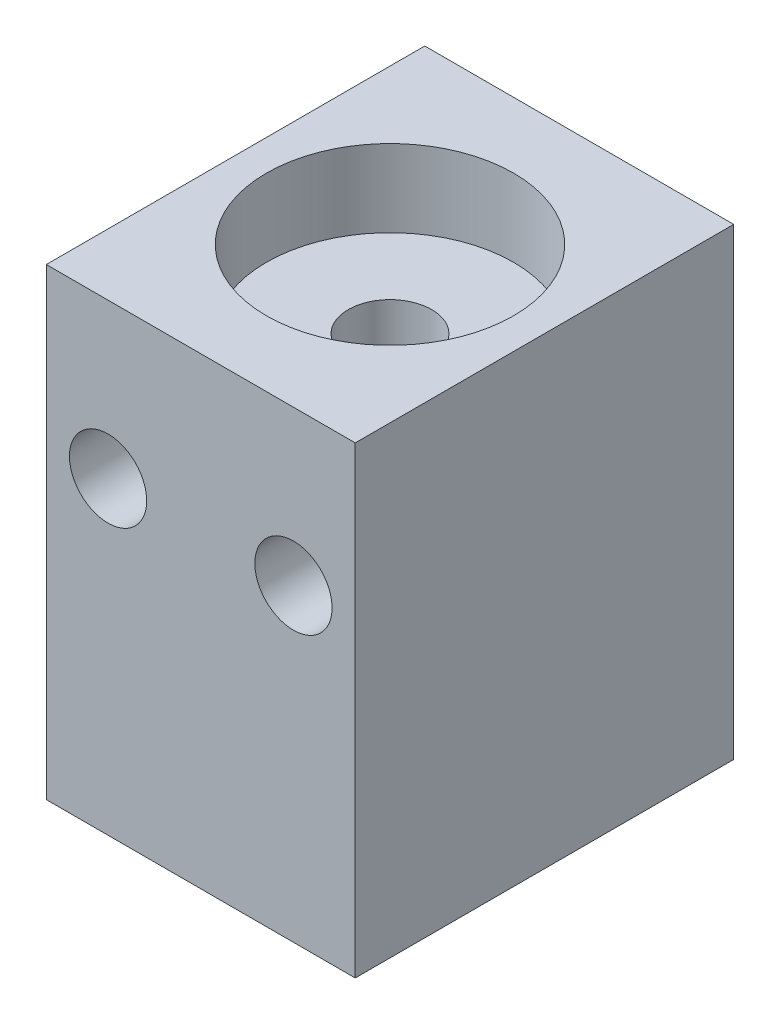
ISO-10303-21;
HEADER;
FILE_DESCRIPTION(('STEP AP214'),'2;1');
FILE_NAME('part.step','',(''),(''),'','','');
FILE_SCHEMA(('AUTOMOTIVE_DESIGN { 1 0 10303 214 1 1 1 1 }'));
ENDSEC;
DATA;
#1=APPLICATION_CONTEXT('core data for automotive mechanical design processes');
#2=APPLICATION_PROTOCOL_DEFINITION('international standard','automotive_design',2000,#1);
#3=PRODUCT_CONTEXT('',#1,'mechanical');
#4=PRODUCT('Part','Part','',(#3));
#5=PRODUCT_RELATED_PRODUCT_CATEGORY('part','',(#4));
#6=PRODUCT_DEFINITION_FORMATION('','',#4);
#7=PRODUCT_DEFINITION_CONTEXT('part definition',#1,'design');
#8=PRODUCT_DEFINITION('design','',#6,#7);
#9=PRODUCT_DEFINITION_SHAPE('','',#8);
#10=(LENGTH_UNIT() NAMED_UNIT(*) SI_UNIT(.MILLI.,.METRE.));
#11=(NAMED_UNIT(*) PLANE_ANGLE_UNIT() SI_UNIT($,.RADIAN.));
#12=(NAMED_UNIT(*) SI_UNIT($,.STERADIAN.) SOLID_ANGLE_UNIT());
#13=UNCERTAINTY_MEASURE_WITH_UNIT(LENGTH_MEASURE(1.E-05),#10,'distance_accuracy_value','');
#14=(GEOMETRIC_REPRESENTATION_CONTEXT(3) GLOBAL_UNCERTAINTY_ASSIGNED_CONTEXT((#13)) GLOBAL_UNIT_ASSIGNED_CONTEXT((#10,
#11,#12)) REPRESENTATION_CONTEXT('',''));
#15=CARTESIAN_POINT('',(0.,0.,0.));
#16=DIRECTION('',(0.,0.,1.));
#17=DIRECTION('',(1.,0.,0.));
#18=AXIS2_PLACEMENT_3D('',#15,#16,#17);
#19=CARTESIAN_POINT('',(10.,-15.,12.25));
#20=DIRECTION('',(-1.,0.,0.));
#21=DIRECTION('',(0.,0.,1.));
#22=AXIS2_PLACEMENT_3D('',#19,#20,#21);
#23=PLANE('',#22);
#24=DIRECTION('',(0.,1.,0.));
#25=VECTOR('',#24,1.);
#26=CARTESIAN_POINT('',(10.,-15.,-12.25));
#27=LINE('',#26,#25);
#28=CARTESIAN_POINT('',(10.,-15.,-12.25));
#29=VERTEX_POINT('',#28);
#30=CARTESIAN_POINT('',(10.,15.,-12.25));
#31=VERTEX_POINT('',#30);
#32=EDGE_CURVE('E95',#29,#31,#27,.T.);
#33=ORIENTED_EDGE('',*,*,#32,.T.);
#34=DIRECTION('',(0.,0.,-1.));
#35=VECTOR('',#34,1.);
#36=CARTESIAN_POINT('',(10.,15.,12.25));
#37=LINE('',#36,#35);
#38=CARTESIAN_POINT('',(10.,15.,12.25));
#39=VERTEX_POINT('',#38);
#40=EDGE_CURVE('E11',#39,#31,#37,.T.);
#41=ORIENTED_EDGE('',*,*,#40,.F.);
#42=DIRECTION('',(0.,1.,0.));
#43=VECTOR('',#42,1.);
#44=CARTESIAN_POINT('',(10.,-15.,12.25));
#45=LINE('',#44,#43);
#46=CARTESIAN_POINT('',(10.,-15.,12.25));
#47=VERTEX_POINT('',#46);
#48=EDGE_CURVE('E83',#47,#39,#45,.T.);
#49=ORIENTED_EDGE('',*,*,#48,.F.);
#50=DIRECTION('',(0.,0.,-1.));
#51=VECTOR('',#50,1.);
#52=CARTESIAN_POINT('',(10.,-15.,12.25));
#53=LINE('',#52,#51);
#54=EDGE_CURVE('E91',#47,#29,#53,.T.);
#55=ORIENTED_EDGE('',*,*,#54,.T.);
#56=EDGE_LOOP('',(#33,#41,#49,#55));
#57=FACE_BOUND('',#56,.T.);
#58=ADVANCED_FACE('F32',(#57),#23,.F.);
#59=CARTESIAN_POINT('',(-10.,15.,12.25));
#60=DIRECTION('',(0.,-1.,0.));
#61=DIRECTION('',(0.,0.,-1.));
#62=AXIS2_PLACEMENT_3D('',#59,#60,#61);
#63=PLANE('',#62);
#64=CARTESIAN_POINT('',(0.,15.,0.));
#65=DIRECTION('',(0.,1.,0.));
#66=DIRECTION('',(0.,0.,1.));
#67=AXIS2_PLACEMENT_3D('',#64,#65,#66);
#68=CIRCLE('',#67,8.);
#69=CARTESIAN_POINT('',(0.,15.,8.));
#70=VERTEX_POINT('',#69);
#71=EDGE_CURVE('E98',#70,#70,#68,.T.);
#72=ORIENTED_EDGE('',*,*,#71,.F.);
#73=EDGE_LOOP('',(#72));
#74=FACE_BOUND('',#73,.T.);
#75=DIRECTION('',(-1.,0.,0.));
#76=VECTOR('',#75,1.);
#77=CARTESIAN_POINT('',(-10.,15.,-12.25));
#78=LINE('',#77,#76);
#79=CARTESIAN_POINT('',(-10.,15.,-12.25));
#80=VERTEX_POINT('',#79);
#81=EDGE_CURVE('E87',#31,#80,#78,.T.);
#82=ORIENTED_EDGE('',*,*,#81,.T.);
#83=DIRECTION('',(0.,0.,-1.));
#84=VECTOR('',#83,1.);
#85=CARTESIAN_POINT('',(-10.,15.,12.25));
#86=LINE('',#85,#84);
#87=CARTESIAN_POINT('',(-10.,15.,12.25));
#88=VERTEX_POINT('',#87);
#89=EDGE_CURVE('E40',#88,#80,#86,.T.);
#90=ORIENTED_EDGE('',*,*,#89,.F.);
#91=DIRECTION('',(-1.,0.,0.));
#92=VECTOR('',#91,1.);
#93=CARTESIAN_POINT('',(-10.,15.,12.25));
#94=LINE('',#93,#92);
#95=EDGE_CURVE('E78',#39,#88,#94,.T.);
#96=ORIENTED_EDGE('',*,*,#95,.F.);
#97=ORIENTED_EDGE('',*,*,#40,.T.);
#98=EDGE_LOOP('',(#82,#90,#96,#97));
#99=FACE_BOUND('',#98,.T.);
#100=ADVANCED_FACE('F86',(#74,#99),#63,.F.);
#101=CARTESIAN_POINT('',(-10.,-15.,12.25));
#102=DIRECTION('',(1.,0.,0.));
#103=DIRECTION('',(0.,0.,-1.));
#104=AXIS2_PLACEMENT_3D('',#101,#102,#103);
#105=PLANE('',#104);
#106=DIRECTION('',(0.,-1.,0.));
#107=VECTOR('',#106,1.);
#108=CARTESIAN_POINT('',(-10.,-15.,-12.25));
#109=LINE('',#108,#107);
#110=CARTESIAN_POINT('',(-10.,-15.,-12.25));
#111=VERTEX_POINT('',#110);
#112=EDGE_CURVE('E65',#80,#111,#109,.T.);
#113=ORIENTED_EDGE('',*,*,#112,.T.);
#114=DIRECTION('',(0.,0.,-1.));
#115=VECTOR('',#114,1.);
#116=CARTESIAN_POINT('',(-10.,-15.,12.25));
#117=LINE('',#116,#115);
#118=CARTESIAN_POINT('',(-10.,-15.,12.25));
#119=VERTEX_POINT('',#118);
#120=EDGE_CURVE('E88',#119,#111,#117,.T.);
#121=ORIENTED_EDGE('',*,*,#120,.F.);
#122=DIRECTION('',(0.,-1.,0.));
#123=VECTOR('',#122,1.);
#124=CARTESIAN_POINT('',(-10.,-15.,12.25));
#125=LINE('',#124,#123);
#126=EDGE_CURVE('E81',#88,#119,#125,.T.);
#127=ORIENTED_EDGE('',*,*,#126,.F.);
#128=ORIENTED_EDGE('',*,*,#89,.T.);
#129=EDGE_LOOP('',(#113,#121,#127,#128));
#130=FACE_BOUND('',#129,.T.);
#131=ADVANCED_FACE('F89',(#130),#105,.F.);
#132=CARTESIAN_POINT('',(-10.,-15.,12.25));
#133=DIRECTION('',(0.,1.,0.));
#134=DIRECTION('',(0.,0.,1.));
#135=AXIS2_PLACEMENT_3D('',#132,#133,#134);
#136=PLANE('',#135);
#137=CARTESIAN_POINT('',(0.,-15.,0.));
#138=DIRECTION('',(0.,1.,0.));
#139=DIRECTION('',(0.,0.,1.));
#140=AXIS2_PLACEMENT_3D('',#137,#138,#139);
#141=CIRCLE('',#140,8.);
#142=CARTESIAN_POINT('',(0.,-15.,8.));
#143=VERTEX_POINT('',#142);
#144=EDGE_CURVE('E123',#143,#143,#141,.T.);
#145=ORIENTED_EDGE('',*,*,#144,.T.);
#146=EDGE_LOOP('',(#145));
#147=FACE_BOUND('',#146,.T.);
#148=DIRECTION('',(1.,0.,0.));
#149=VECTOR('',#148,1.);
#150=CARTESIAN_POINT('',(-10.,-15.,-12.25));
#151=LINE('',#150,#149);
#152=EDGE_CURVE('E71',#111,#29,#151,.T.);
#153=ORIENTED_EDGE('',*,*,#152,.T.);
#154=ORIENTED_EDGE('',*,*,#54,.F.);
#155=DIRECTION('',(1.,0.,0.));
#156=VECTOR('',#155,1.);
#157=CARTESIAN_POINT('',(-10.,-15.,12.25));
#158=LINE('',#157,#156);
#159=EDGE_CURVE('E48',#119,#47,#158,.T.);
#160=ORIENTED_EDGE('',*,*,#159,.F.);
#161=ORIENTED_EDGE('',*,*,#120,.T.);
#162=EDGE_LOOP('',(#153,#154,#160,#161));
#163=FACE_BOUND('',#162,.T.);
#164=ADVANCED_FACE('F103',(#147,#163),#136,.F.);
#165=CARTESIAN_POINT('',(0.,0.,12.25));
#166=DIRECTION('',(0.,0.,-1.));
#167=DIRECTION('',(-1.,0.,0.));
#168=AXIS2_PLACEMENT_3D('',#165,#166,#167);
#169=PLANE('',#168);
#170=CARTESIAN_POINT('',(6.,5.,12.25));
#171=DIRECTION('',(0.,0.,-1.));
#172=DIRECTION('',(-1.,0.,0.));
#173=AXIS2_PLACEMENT_3D('',#170,#171,#172);
#174=CIRCLE('',#173,2.5);
#175=CARTESIAN_POINT('',(3.5,5.,12.25));
#176=VERTEX_POINT('',#175);
#177=EDGE_CURVE('E126',#176,#176,#174,.T.);
#178=ORIENTED_EDGE('',*,*,#177,.T.);
#179=EDGE_LOOP('',(#178));
#180=FACE_BOUND('',#179,.T.);
#181=CARTESIAN_POINT('',(-6.,5.,12.25));
#182=DIRECTION('',(0.,0.,-1.));
#183=DIRECTION('',(-1.,0.,0.));
#184=AXIS2_PLACEMENT_3D('',#181,#182,#183);
#185=CIRCLE('',#184,2.5);
#186=CARTESIAN_POINT('',(-8.5,5.,12.25));
#187=VERTEX_POINT('',#186);
#188=EDGE_CURVE('E130',#187,#187,#185,.T.);
#189=ORIENTED_EDGE('',*,*,#188,.T.);
#190=EDGE_LOOP('',(#189));
#191=FACE_BOUND('',#190,.T.);
#192=ORIENTED_EDGE('',*,*,#48,.T.);
#193=ORIENTED_EDGE('',*,*,#95,.T.);
#194=ORIENTED_EDGE('',*,*,#126,.T.);
#195=ORIENTED_EDGE('',*,*,#159,.T.);
#196=EDGE_LOOP('',(#192,#193,#194,#195));
#197=FACE_BOUND('',#196,.T.);
#198=ADVANCED_FACE('F79',(#180,#191,#197),#169,.F.);
#199=CARTESIAN_POINT('',(0.,0.,-12.25));
#200=DIRECTION('',(0.,0.,-1.));
#201=DIRECTION('',(-1.,0.,0.));
#202=AXIS2_PLACEMENT_3D('',#199,#200,#201);
#203=PLANE('',#202);
#204=CARTESIAN_POINT('',(6.,5.,-12.25));
#205=DIRECTION('',(0.,0.,-1.));
#206=DIRECTION('',(-1.,0.,0.));
#207=AXIS2_PLACEMENT_3D('',#204,#205,#206);
#208=CIRCLE('',#207,2.5);
#209=CARTESIAN_POINT('',(3.5,5.,-12.25));
#210=VERTEX_POINT('',#209);
#211=EDGE_CURVE('E133',#210,#210,#208,.T.);
#212=ORIENTED_EDGE('',*,*,#211,.F.);
#213=EDGE_LOOP('',(#212));
#214=FACE_BOUND('',#213,.T.);
#215=CARTESIAN_POINT('',(-6.,5.,-12.25));
#216=DIRECTION('',(0.,0.,-1.));
#217=DIRECTION('',(-1.,0.,0.));
#218=AXIS2_PLACEMENT_3D('',#215,#216,#217);
#219=CIRCLE('',#218,2.5);
#220=CARTESIAN_POINT('',(-8.5,5.,-12.25));
#221=VERTEX_POINT('',#220);
#222=EDGE_CURVE('E127',#221,#221,#219,.T.);
#223=ORIENTED_EDGE('',*,*,#222,.F.);
#224=EDGE_LOOP('',(#223));
#225=FACE_BOUND('',#224,.T.);
#226=ORIENTED_EDGE('',*,*,#32,.F.);
#227=ORIENTED_EDGE('',*,*,#152,.F.);
#228=ORIENTED_EDGE('',*,*,#112,.F.);
#229=ORIENTED_EDGE('',*,*,#81,.F.);
#230=EDGE_LOOP('',(#226,#227,#228,#229));
#231=FACE_BOUND('',#230,.T.);
#232=ADVANCED_FACE('F106',(#214,#225,#231),#203,.T.);
#233=CARTESIAN_POINT('',(0.,15.,0.));
#234=DIRECTION('',(0.,1.,0.));
#235=DIRECTION('',(0.,0.,1.));
#236=AXIS2_PLACEMENT_3D('',#233,#234,#235);
#237=CYLINDRICAL_SURFACE('',#236,8.);
#238=ORIENTED_EDGE('',*,*,#71,.T.);
#239=EDGE_LOOP('',(#238));
#240=FACE_BOUND('',#239,.T.);
#241=CARTESIAN_POINT('',(0.,10.,0.));
#242=DIRECTION('',(0.,1.,0.));
#243=DIRECTION('',(0.,0.,1.));
#244=AXIS2_PLACEMENT_3D('',#241,#242,#243);
#245=CIRCLE('',#244,8.);
#246=CARTESIAN_POINT('',(0.,10.,8.));
#247=VERTEX_POINT('',#246);
#248=EDGE_CURVE('E111',#247,#247,#245,.T.);
#249=ORIENTED_EDGE('',*,*,#248,.F.);
#250=EDGE_LOOP('',(#249));
#251=FACE_BOUND('',#250,.T.);
#252=ADVANCED_FACE('F150',(#240,#251),#237,.F.);
#253=CARTESIAN_POINT('',(0.,10.,-8.));
#254=DIRECTION('',(0.,1.,0.));
#255=DIRECTION('',(0.,0.,1.));
#256=AXIS2_PLACEMENT_3D('',#253,#254,#255);
#257=PLANE('',#256);
#258=ORIENTED_EDGE('',*,*,#248,.T.);
#259=EDGE_LOOP('',(#258));
#260=FACE_BOUND('',#259,.T.);
#261=CARTESIAN_POINT('',(0.,10.,0.));
#262=DIRECTION('',(0.,1.,0.));
#263=DIRECTION('',(0.,0.,1.));
#264=AXIS2_PLACEMENT_3D('',#261,#262,#263);
#265=CIRCLE('',#264,2.7);
#266=CARTESIAN_POINT('',(0.,10.,2.7));
#267=VERTEX_POINT('',#266);
#268=EDGE_CURVE('E114',#267,#267,#265,.T.);
#269=ORIENTED_EDGE('',*,*,#268,.F.);
#270=EDGE_LOOP('',(#269));
#271=FACE_BOUND('',#270,.T.);
#272=ADVANCED_FACE('F183',(#260,#271),#257,.T.);
#273=CARTESIAN_POINT('',(0.,15.,0.));
#274=DIRECTION('',(0.,1.,0.));
#275=DIRECTION('',(0.,0.,1.));
#276=AXIS2_PLACEMENT_3D('',#273,#274,#275);
#277=CYLINDRICAL_SURFACE('',#276,2.7);
#278=ORIENTED_EDGE('',*,*,#268,.T.);
#279=EDGE_LOOP('',(#278));
#280=FACE_BOUND('',#279,.T.);
#281=CARTESIAN_POINT('',(0.,-10.,0.));
#282=DIRECTION('',(0.,1.,0.));
#283=DIRECTION('',(0.,0.,1.));
#284=AXIS2_PLACEMENT_3D('',#281,#282,#283);
#285=CIRCLE('',#284,2.7);
#286=CARTESIAN_POINT('',(0.,-10.,2.7));
#287=VERTEX_POINT('',#286);
#288=EDGE_CURVE('E117',#287,#287,#285,.T.);
#289=ORIENTED_EDGE('',*,*,#288,.F.);
#290=EDGE_LOOP('',(#289));
#291=FACE_BOUND('',#290,.T.);
#292=ADVANCED_FACE('F187',(#280,#291),#277,.F.);
#293=CARTESIAN_POINT('',(0.,-10.,-2.7));
#294=DIRECTION('',(0.,-1.,0.));
#295=DIRECTION('',(0.,0.,-1.));
#296=AXIS2_PLACEMENT_3D('',#293,#294,#295);
#297=PLANE('',#296);
#298=ORIENTED_EDGE('',*,*,#288,.T.);
#299=EDGE_LOOP('',(#298));
#300=FACE_BOUND('',#299,.T.);
#301=CARTESIAN_POINT('',(0.,-9.99999999999999,0.));
#302=DIRECTION('',(0.,1.,0.));
#303=DIRECTION('',(0.,0.,1.));
#304=AXIS2_PLACEMENT_3D('',#301,#302,#303);
#305=CIRCLE('',#304,8.);
#306=CARTESIAN_POINT('',(0.,-9.99999999999999,8.));
#307=VERTEX_POINT('',#306);
#308=EDGE_CURVE('E120',#307,#307,#305,.T.);
#309=ORIENTED_EDGE('',*,*,#308,.F.);
#310=EDGE_LOOP('',(#309));
#311=FACE_BOUND('',#310,.T.);
#312=ADVANCED_FACE('F161',(#300,#311),#297,.T.);
#313=CARTESIAN_POINT('',(0.,15.,0.));
#314=DIRECTION('',(0.,1.,0.));
#315=DIRECTION('',(0.,0.,1.));
#316=AXIS2_PLACEMENT_3D('',#313,#314,#315);
#317=CYLINDRICAL_SURFACE('',#316,8.);
#318=ORIENTED_EDGE('',*,*,#308,.T.);
#319=EDGE_LOOP('',(#318));
#320=FACE_BOUND('',#319,.T.);
#321=ORIENTED_EDGE('',*,*,#144,.F.);
#322=EDGE_LOOP('',(#321));
#323=FACE_BOUND('',#322,.T.);
#324=ADVANCED_FACE('F155',(#320,#323),#317,.F.);
#325=CARTESIAN_POINT('',(-6.,5.,12.25));
#326=DIRECTION('',(0.,0.,-1.));
#327=DIRECTION('',(-1.,0.,0.));
#328=AXIS2_PLACEMENT_3D('',#325,#326,#327);
#329=CYLINDRICAL_SURFACE('',#328,2.5);
#330=ORIENTED_EDGE('',*,*,#188,.F.);
#331=EDGE_LOOP('',(#330));
#332=FACE_BOUND('',#331,.T.);
#333=ORIENTED_EDGE('',*,*,#222,.T.);
#334=EDGE_LOOP('',(#333));
#335=FACE_BOUND('',#334,.T.);
#336=ADVANCED_FACE('F144',(#332,#335),#329,.F.);
#337=CARTESIAN_POINT('',(6.,5.,12.25));
#338=DIRECTION('',(0.,0.,-1.));
#339=DIRECTION('',(-1.,0.,0.));
#340=AXIS2_PLACEMENT_3D('',#337,#338,#339);
#341=CYLINDRICAL_SURFACE('',#340,2.5);
#342=ORIENTED_EDGE('',*,*,#177,.F.);
#343=EDGE_LOOP('',(#342));
#344=FACE_BOUND('',#343,.T.);
#345=ORIENTED_EDGE('',*,*,#211,.T.);
#346=EDGE_LOOP('',(#345));
#347=FACE_BOUND('',#346,.T.);
#348=ADVANCED_FACE('F141',(#344,#347),#341,.F.);
#349=CLOSED_SHELL('',(#58,#100,#131,#164,#198,#232,#252,#272,#292,#312,#324,#336,#348));
#350=MANIFOLD_SOLID_BREP('B2',#349);
#351=ADVANCED_BREP_SHAPE_REPRESENTATION('',(#18,#350),#14);
#352=SHAPE_DEFINITION_REPRESENTATION(#9,#351);
ENDSEC;
END-ISO-10303-21;
